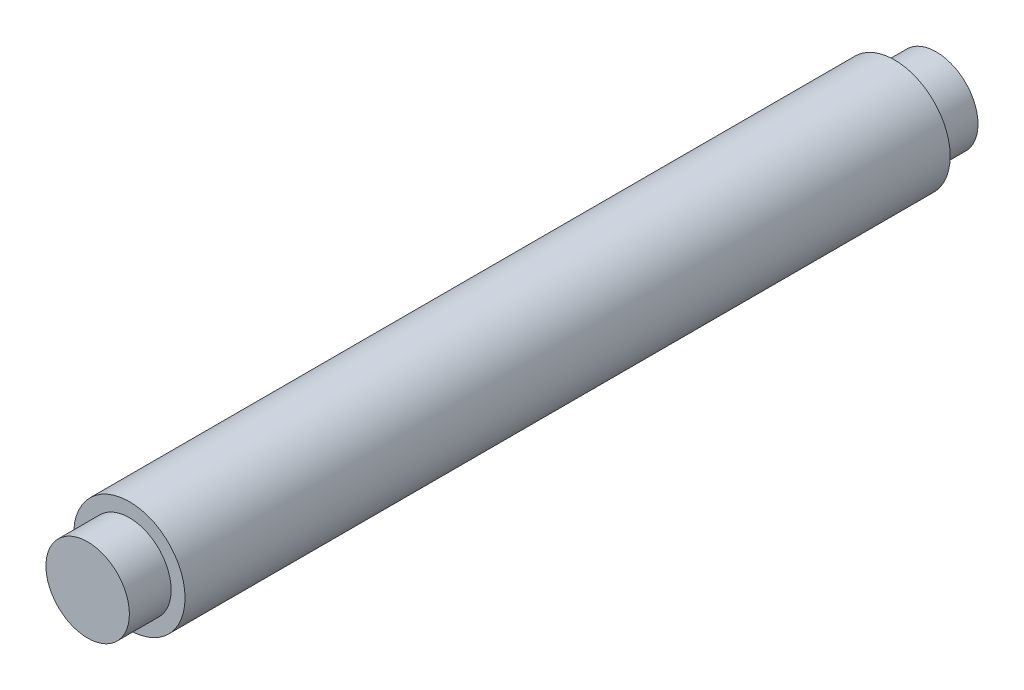
ISO-10303-21;
HEADER;
FILE_DESCRIPTION(('STEP AP214'),'2;1');
FILE_NAME('part.step','',(''),(''),'','','');
FILE_SCHEMA(('AUTOMOTIVE_DESIGN { 1 0 10303 214 1 1 1 1 }'));
ENDSEC;
DATA;
#1=APPLICATION_CONTEXT('core data for automotive mechanical design processes');
#2=APPLICATION_PROTOCOL_DEFINITION('international standard','automotive_design',2000,#1);
#3=PRODUCT_CONTEXT('',#1,'mechanical');
#4=PRODUCT('Part','Part','',(#3));
#5=PRODUCT_RELATED_PRODUCT_CATEGORY('part','',(#4));
#6=PRODUCT_DEFINITION_FORMATION('','',#4);
#7=PRODUCT_DEFINITION_CONTEXT('part definition',#1,'design');
#8=PRODUCT_DEFINITION('design','',#6,#7);
#9=PRODUCT_DEFINITION_SHAPE('','',#8);
#10=(LENGTH_UNIT() NAMED_UNIT(*) SI_UNIT(.MILLI.,.METRE.));
#11=(NAMED_UNIT(*) PLANE_ANGLE_UNIT() SI_UNIT($,.RADIAN.));
#12=(NAMED_UNIT(*) SI_UNIT($,.STERADIAN.) SOLID_ANGLE_UNIT());
#13=UNCERTAINTY_MEASURE_WITH_UNIT(LENGTH_MEASURE(1.E-05),#10,'distance_accuracy_value','');
#14=(GEOMETRIC_REPRESENTATION_CONTEXT(3) GLOBAL_UNCERTAINTY_ASSIGNED_CONTEXT((#13)) GLOBAL_UNIT_ASSIGNED_CONTEXT((#10,
#11,#12)) REPRESENTATION_CONTEXT('',''));
#15=CARTESIAN_POINT('',(0.,0.,0.));
#16=DIRECTION('',(0.,0.,1.));
#17=DIRECTION('',(1.,0.,0.));
#18=AXIS2_PLACEMENT_3D('',#15,#16,#17);
#19=CARTESIAN_POINT('',(0.,0.,55.));
#20=DIRECTION('',(0.,0.,-1.));
#21=DIRECTION('',(-1.,0.,0.));
#22=AXIS2_PLACEMENT_3D('',#19,#20,#21);
#23=CYLINDRICAL_SURFACE('',#22,4.);
#24=CARTESIAN_POINT('',(0.,0.,55.));
#25=DIRECTION('',(0.,0.,1.));
#26=DIRECTION('',(1.,0.,0.));
#27=AXIS2_PLACEMENT_3D('',#24,#25,#26);
#28=CIRCLE('',#27,4.);
#29=CARTESIAN_POINT('',(4.,0.,55.));
#30=VERTEX_POINT('',#29);
#31=EDGE_CURVE('E39',#30,#30,#28,.T.);
#32=ORIENTED_EDGE('',*,*,#31,.F.);
#33=EDGE_LOOP('',(#32));
#34=FACE_BOUND('',#33,.T.);
#35=CARTESIAN_POINT('',(0.,0.,0.));
#36=DIRECTION('',(0.,0.,1.));
#37=DIRECTION('',(1.,0.,0.));
#38=AXIS2_PLACEMENT_3D('',#35,#36,#37);
#39=CIRCLE('',#38,4.);
#40=CARTESIAN_POINT('',(4.,0.,0.));
#41=VERTEX_POINT('',#40);
#42=EDGE_CURVE('E43',#41,#41,#39,.T.);
#43=ORIENTED_EDGE('',*,*,#42,.T.);
#44=EDGE_LOOP('',(#43));
#45=FACE_BOUND('',#44,.T.);
#46=ADVANCED_FACE('F33',(#34,#45),#23,.T.);
#47=CARTESIAN_POINT('',(0.,0.,55.));
#48=DIRECTION('',(0.,0.,1.));
#49=DIRECTION('',(1.,0.,0.));
#50=AXIS2_PLACEMENT_3D('',#47,#48,#49);
#51=PLANE('',#50);
#52=CARTESIAN_POINT('',(0.,0.,55.));
#53=DIRECTION('',(0.,0.,1.));
#54=DIRECTION('',(1.,0.,0.));
#55=AXIS2_PLACEMENT_3D('',#52,#53,#54);
#56=CIRCLE('',#55,3.);
#57=CARTESIAN_POINT('',(3.,0.,55.));
#58=VERTEX_POINT('',#57);
#59=EDGE_CURVE('E50',#58,#58,#56,.T.);
#60=ORIENTED_EDGE('',*,*,#59,.F.);
#61=EDGE_LOOP('',(#60));
#62=FACE_BOUND('',#61,.T.);
#63=ORIENTED_EDGE('',*,*,#31,.T.);
#64=EDGE_LOOP('',(#63));
#65=FACE_BOUND('',#64,.T.);
#66=ADVANCED_FACE('F74',(#62,#65),#51,.T.);
#67=CARTESIAN_POINT('',(0.,0.,0.));
#68=DIRECTION('',(0.,0.,1.));
#69=DIRECTION('',(1.,0.,0.));
#70=AXIS2_PLACEMENT_3D('',#67,#68,#69);
#71=PLANE('',#70);
#72=CARTESIAN_POINT('',(0.,0.,0.));
#73=DIRECTION('',(0.,0.,1.));
#74=DIRECTION('',(1.,0.,0.));
#75=AXIS2_PLACEMENT_3D('',#72,#73,#74);
#76=CIRCLE('',#75,3.);
#77=CARTESIAN_POINT('',(3.,0.,0.));
#78=VERTEX_POINT('',#77);
#79=EDGE_CURVE('E10',#78,#78,#76,.F.);
#80=ORIENTED_EDGE('',*,*,#79,.F.);
#81=EDGE_LOOP('',(#80));
#82=FACE_BOUND('',#81,.T.);
#83=ORIENTED_EDGE('',*,*,#42,.F.);
#84=EDGE_LOOP('',(#83));
#85=FACE_BOUND('',#84,.T.);
#86=ADVANCED_FACE('F79',(#82,#85),#71,.F.);
#87=CARTESIAN_POINT('',(0.,0.,58.));
#88=DIRECTION('',(0.,0.,-1.));
#89=DIRECTION('',(-1.,0.,0.));
#90=AXIS2_PLACEMENT_3D('',#87,#88,#89);
#91=CYLINDRICAL_SURFACE('',#90,3.);
#92=CARTESIAN_POINT('',(0.,0.,58.));
#93=DIRECTION('',(0.,0.,1.));
#94=DIRECTION('',(1.,0.,0.));
#95=AXIS2_PLACEMENT_3D('',#92,#93,#94);
#96=CIRCLE('',#95,3.);
#97=CARTESIAN_POINT('',(3.,0.,58.));
#98=VERTEX_POINT('',#97);
#99=EDGE_CURVE('E48',#98,#98,#96,.T.);
#100=ORIENTED_EDGE('',*,*,#99,.F.);
#101=EDGE_LOOP('',(#100));
#102=FACE_BOUND('',#101,.T.);
#103=ORIENTED_EDGE('',*,*,#59,.T.);
#104=EDGE_LOOP('',(#103));
#105=FACE_BOUND('',#104,.T.);
#106=ADVANCED_FACE('F70',(#102,#105),#91,.T.);
#107=CARTESIAN_POINT('',(0.,0.,58.));
#108=DIRECTION('',(0.,0.,1.));
#109=DIRECTION('',(1.,0.,0.));
#110=AXIS2_PLACEMENT_3D('',#107,#108,#109);
#111=PLANE('',#110);
#112=ORIENTED_EDGE('',*,*,#99,.T.);
#113=EDGE_LOOP('',(#112));
#114=FACE_BOUND('',#113,.T.);
#115=ADVANCED_FACE('F63',(#114),#111,.T.);
#116=CARTESIAN_POINT('',(0.,0.,-3.));
#117=DIRECTION('',(0.,0.,1.));
#118=DIRECTION('',(1.,0.,0.));
#119=AXIS2_PLACEMENT_3D('',#116,#117,#118);
#120=CYLINDRICAL_SURFACE('',#119,3.);
#121=CARTESIAN_POINT('',(0.,0.,-3.));
#122=DIRECTION('',(0.,0.,-1.));
#123=DIRECTION('',(-1.,0.,0.));
#124=AXIS2_PLACEMENT_3D('',#121,#122,#123);
#125=CIRCLE('',#124,3.);
#126=CARTESIAN_POINT('',(-3.,0.,-3.));
#127=VERTEX_POINT('',#126);
#128=EDGE_CURVE('E53',#127,#127,#125,.T.);
#129=ORIENTED_EDGE('',*,*,#128,.F.);
#130=EDGE_LOOP('',(#129));
#131=FACE_BOUND('',#130,.T.);
#132=ORIENTED_EDGE('',*,*,#79,.T.);
#133=EDGE_LOOP('',(#132));
#134=FACE_BOUND('',#133,.T.);
#135=ADVANCED_FACE('F61',(#131,#134),#120,.T.);
#136=CARTESIAN_POINT('',(0.,0.,-3.));
#137=DIRECTION('',(0.,0.,-1.));
#138=DIRECTION('',(-1.,0.,0.));
#139=AXIS2_PLACEMENT_3D('',#136,#137,#138);
#140=PLANE('',#139);
#141=ORIENTED_EDGE('',*,*,#128,.T.);
#142=EDGE_LOOP('',(#141));
#143=FACE_BOUND('',#142,.T.);
#144=ADVANCED_FACE('F59',(#143),#140,.T.);
#145=CLOSED_SHELL('',(#46,#66,#86,#106,#115,#135,#144));
#146=MANIFOLD_SOLID_BREP('B2',#145);
#147=ADVANCED_BREP_SHAPE_REPRESENTATION('',(#18,#146),#14);
#148=SHAPE_DEFINITION_REPRESENTATION(#9,#147);
ENDSEC;
END-ISO-10303-21;
